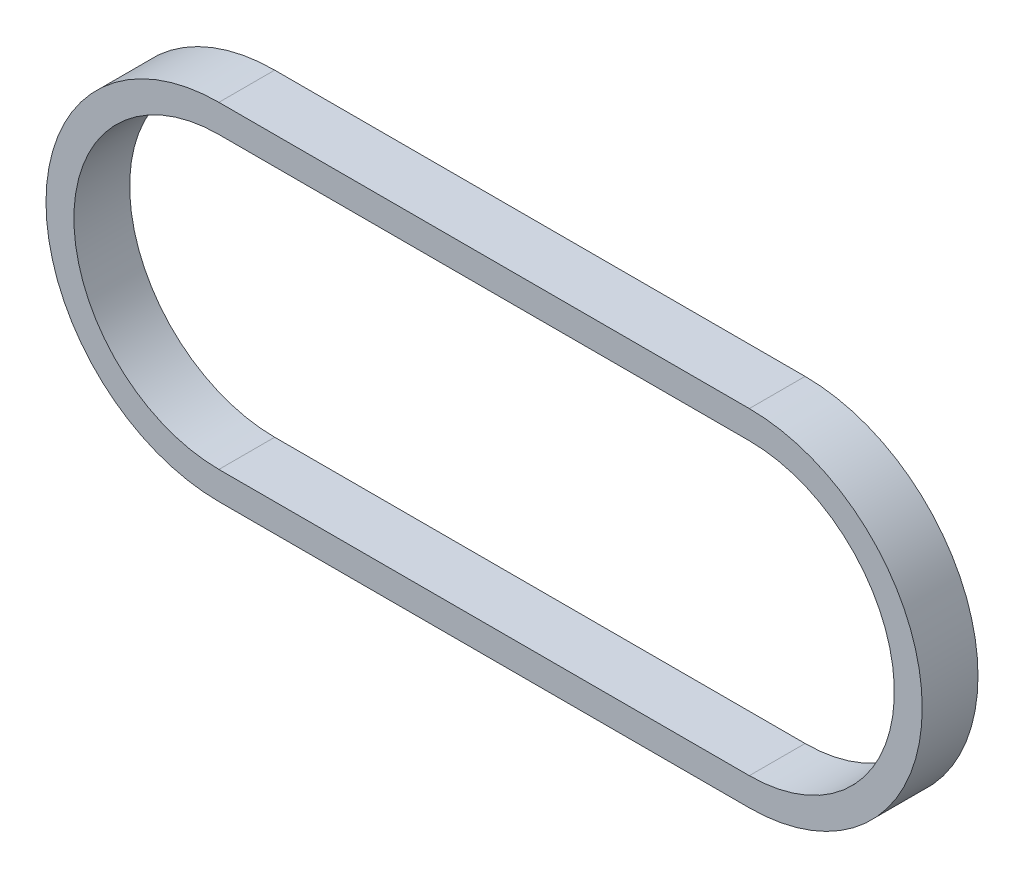
ISO-10303-21;
HEADER;
FILE_DESCRIPTION(('STEP AP214'),'2;1');
FILE_NAME('part.step','',(''),(''),'','','');
FILE_SCHEMA(('AUTOMOTIVE_DESIGN { 1 0 10303 214 1 1 1 1 }'));
ENDSEC;
DATA;
#1=APPLICATION_CONTEXT('core data for automotive mechanical design processes');
#2=APPLICATION_PROTOCOL_DEFINITION('international standard','automotive_design',2000,#1);
#3=PRODUCT_CONTEXT('',#1,'mechanical');
#4=PRODUCT('Part','Part','',(#3));
#5=PRODUCT_RELATED_PRODUCT_CATEGORY('part','',(#4));
#6=PRODUCT_DEFINITION_FORMATION('','',#4);
#7=PRODUCT_DEFINITION_CONTEXT('part definition',#1,'design');
#8=PRODUCT_DEFINITION('design','',#6,#7);
#9=PRODUCT_DEFINITION_SHAPE('','',#8);
#10=(LENGTH_UNIT() NAMED_UNIT(*) SI_UNIT(.MILLI.,.METRE.));
#11=(NAMED_UNIT(*) PLANE_ANGLE_UNIT() SI_UNIT($,.RADIAN.));
#12=(NAMED_UNIT(*) SI_UNIT($,.STERADIAN.) SOLID_ANGLE_UNIT());
#13=UNCERTAINTY_MEASURE_WITH_UNIT(LENGTH_MEASURE(1.E-05),#10,'distance_accuracy_value','');
#14=(GEOMETRIC_REPRESENTATION_CONTEXT(3) GLOBAL_UNCERTAINTY_ASSIGNED_CONTEXT((#13)) GLOBAL_UNIT_ASSIGNED_CONTEXT((#10,
#11,#12)) REPRESENTATION_CONTEXT('',''));
#15=CARTESIAN_POINT('',(0.,0.,0.));
#16=DIRECTION('',(0.,0.,1.));
#17=DIRECTION('',(1.,0.,0.));
#18=AXIS2_PLACEMENT_3D('',#15,#16,#17);
#19=CARTESIAN_POINT('',(0.,0.,10.));
#20=DIRECTION('',(0.,0.,1.));
#21=DIRECTION('',(1.,0.,0.));
#22=AXIS2_PLACEMENT_3D('',#19,#20,#21);
#23=PLANE('',#22);
#24=CARTESIAN_POINT('',(0.,0.,10.));
#25=DIRECTION('',(0.,0.,1.));
#26=DIRECTION('',(1.,0.,0.));
#27=AXIS2_PLACEMENT_3D('',#24,#25,#26);
#28=CIRCLE('',#27,31.);
#29=CARTESIAN_POINT('',(0.,31.,10.));
#30=VERTEX_POINT('',#29);
#31=CARTESIAN_POINT('',(0.,-31.,10.));
#32=VERTEX_POINT('',#31);
#33=EDGE_CURVE('E147',#30,#32,#28,.T.);
#34=ORIENTED_EDGE('',*,*,#33,.T.);
#35=DIRECTION('',(1.,0.,0.));
#36=VECTOR('',#35,1.);
#37=CARTESIAN_POINT('',(0.,-31.,10.));
#38=LINE('',#37,#36);
#39=CARTESIAN_POINT('',(95.1,-31.,10.));
#40=VERTEX_POINT('',#39);
#41=EDGE_CURVE('E150',#32,#40,#38,.T.);
#42=ORIENTED_EDGE('',*,*,#41,.T.);
#43=CARTESIAN_POINT('',(95.1,0.,10.));
#44=DIRECTION('',(0.,0.,1.));
#45=DIRECTION('',(1.,0.,0.));
#46=AXIS2_PLACEMENT_3D('',#43,#44,#45);
#47=CIRCLE('',#46,31.);
#48=CARTESIAN_POINT('',(95.1,31.,10.));
#49=VERTEX_POINT('',#48);
#50=EDGE_CURVE('E153',#40,#49,#47,.T.);
#51=ORIENTED_EDGE('',*,*,#50,.T.);
#52=DIRECTION('',(-1.,0.,0.));
#53=VECTOR('',#52,1.);
#54=CARTESIAN_POINT('',(0.,31.,10.));
#55=LINE('',#54,#53);
#56=EDGE_CURVE('E155',#49,#30,#55,.T.);
#57=ORIENTED_EDGE('',*,*,#56,.T.);
#58=EDGE_LOOP('',(#34,#42,#51,#57));
#59=FACE_BOUND('',#58,.T.);
#60=DIRECTION('',(1.,0.,0.));
#61=VECTOR('',#60,1.);
#62=CARTESIAN_POINT('',(0.,-26.,10.));
#63=LINE('',#62,#61);
#64=CARTESIAN_POINT('',(0.,-26.,10.));
#65=VERTEX_POINT('',#64);
#66=CARTESIAN_POINT('',(95.1,-26.,10.));
#67=VERTEX_POINT('',#66);
#68=EDGE_CURVE('E119',#65,#67,#63,.T.);
#69=ORIENTED_EDGE('',*,*,#68,.F.);
#70=CARTESIAN_POINT('',(0.,0.,10.));
#71=DIRECTION('',(0.,0.,1.));
#72=DIRECTION('',(1.,0.,0.));
#73=AXIS2_PLACEMENT_3D('',#70,#71,#72);
#74=CIRCLE('',#73,26.);
#75=CARTESIAN_POINT('',(0.,26.,10.));
#76=VERTEX_POINT('',#75);
#77=EDGE_CURVE('E111',#76,#65,#74,.T.);
#78=ORIENTED_EDGE('',*,*,#77,.F.);
#79=DIRECTION('',(-1.,0.,0.));
#80=VECTOR('',#79,1.);
#81=CARTESIAN_POINT('',(0.,26.,10.));
#82=LINE('',#81,#80);
#83=CARTESIAN_POINT('',(95.1,26.,10.));
#84=VERTEX_POINT('',#83);
#85=EDGE_CURVE('E133',#84,#76,#82,.T.);
#86=ORIENTED_EDGE('',*,*,#85,.F.);
#87=CARTESIAN_POINT('',(95.1,0.,10.));
#88=DIRECTION('',(0.,0.,1.));
#89=DIRECTION('',(1.,0.,0.));
#90=AXIS2_PLACEMENT_3D('',#87,#88,#89);
#91=CIRCLE('',#90,26.);
#92=EDGE_CURVE('E131',#67,#84,#91,.T.);
#93=ORIENTED_EDGE('',*,*,#92,.F.);
#94=EDGE_LOOP('',(#69,#78,#86,#93));
#95=FACE_BOUND('',#94,.T.);
#96=ADVANCED_FACE('F46',(#59,#95),#23,.T.);
#97=CARTESIAN_POINT('',(0.,0.,0.));
#98=DIRECTION('',(0.,0.,1.));
#99=DIRECTION('',(1.,0.,0.));
#100=AXIS2_PLACEMENT_3D('',#97,#98,#99);
#101=PLANE('',#100);
#102=CARTESIAN_POINT('',(0.,0.,0.));
#103=DIRECTION('',(0.,0.,1.));
#104=DIRECTION('',(1.,0.,0.));
#105=AXIS2_PLACEMENT_3D('',#102,#103,#104);
#106=CIRCLE('',#105,31.);
#107=CARTESIAN_POINT('',(0.,31.,0.));
#108=VERTEX_POINT('',#107);
#109=CARTESIAN_POINT('',(0.,-31.,0.));
#110=VERTEX_POINT('',#109);
#111=EDGE_CURVE('E127',#108,#110,#106,.T.);
#112=ORIENTED_EDGE('',*,*,#111,.F.);
#113=DIRECTION('',(-1.,0.,0.));
#114=VECTOR('',#113,1.);
#115=CARTESIAN_POINT('',(0.,31.,0.));
#116=LINE('',#115,#114);
#117=CARTESIAN_POINT('',(95.1,31.,0.));
#118=VERTEX_POINT('',#117);
#119=EDGE_CURVE('E151',#118,#108,#116,.T.);
#120=ORIENTED_EDGE('',*,*,#119,.F.);
#121=CARTESIAN_POINT('',(95.1,0.,0.));
#122=DIRECTION('',(0.,0.,1.));
#123=DIRECTION('',(1.,0.,0.));
#124=AXIS2_PLACEMENT_3D('',#121,#122,#123);
#125=CIRCLE('',#124,31.);
#126=CARTESIAN_POINT('',(95.1,-31.,0.));
#127=VERTEX_POINT('',#126);
#128=EDGE_CURVE('E162',#127,#118,#125,.T.);
#129=ORIENTED_EDGE('',*,*,#128,.F.);
#130=DIRECTION('',(1.,0.,0.));
#131=VECTOR('',#130,1.);
#132=CARTESIAN_POINT('',(0.,-31.,0.));
#133=LINE('',#132,#131);
#134=EDGE_CURVE('E160',#110,#127,#133,.T.);
#135=ORIENTED_EDGE('',*,*,#134,.F.);
#136=EDGE_LOOP('',(#112,#120,#129,#135));
#137=FACE_BOUND('',#136,.T.);
#138=CARTESIAN_POINT('',(0.,0.,0.));
#139=DIRECTION('',(0.,0.,1.));
#140=DIRECTION('',(1.,0.,0.));
#141=AXIS2_PLACEMENT_3D('',#138,#139,#140);
#142=CIRCLE('',#141,26.);
#143=CARTESIAN_POINT('',(0.,26.,0.));
#144=VERTEX_POINT('',#143);
#145=CARTESIAN_POINT('',(0.,-26.,0.));
#146=VERTEX_POINT('',#145);
#147=EDGE_CURVE('E69',#144,#146,#142,.T.);
#148=ORIENTED_EDGE('',*,*,#147,.T.);
#149=DIRECTION('',(1.,0.,0.));
#150=VECTOR('',#149,1.);
#151=CARTESIAN_POINT('',(0.,-26.,0.));
#152=LINE('',#151,#150);
#153=CARTESIAN_POINT('',(95.1,-26.,0.));
#154=VERTEX_POINT('',#153);
#155=EDGE_CURVE('E126',#146,#154,#152,.T.);
#156=ORIENTED_EDGE('',*,*,#155,.T.);
#157=CARTESIAN_POINT('',(95.1,0.,0.));
#158=DIRECTION('',(0.,0.,1.));
#159=DIRECTION('',(1.,0.,0.));
#160=AXIS2_PLACEMENT_3D('',#157,#158,#159);
#161=CIRCLE('',#160,26.);
#162=CARTESIAN_POINT('',(95.1,26.,0.));
#163=VERTEX_POINT('',#162);
#164=EDGE_CURVE('E139',#154,#163,#161,.T.);
#165=ORIENTED_EDGE('',*,*,#164,.T.);
#166=DIRECTION('',(-1.,0.,0.));
#167=VECTOR('',#166,1.);
#168=CARTESIAN_POINT('',(0.,26.,0.));
#169=LINE('',#168,#167);
#170=EDGE_CURVE('E120',#163,#144,#169,.T.);
#171=ORIENTED_EDGE('',*,*,#170,.T.);
#172=EDGE_LOOP('',(#148,#156,#165,#171));
#173=FACE_BOUND('',#172,.T.);
#174=ADVANCED_FACE('F180',(#137,#173),#101,.F.);
#175=CARTESIAN_POINT('',(0.,0.,10.));
#176=DIRECTION('',(0.,0.,-1.));
#177=DIRECTION('',(-1.,0.,0.));
#178=AXIS2_PLACEMENT_3D('',#175,#176,#177);
#179=CYLINDRICAL_SURFACE('',#178,31.);
#180=ORIENTED_EDGE('',*,*,#111,.T.);
#181=DIRECTION('',(0.,0.,-1.));
#182=VECTOR('',#181,1.);
#183=CARTESIAN_POINT('',(0.,-31.,10.));
#184=LINE('',#183,#182);
#185=EDGE_CURVE('E13',#32,#110,#184,.T.);
#186=ORIENTED_EDGE('',*,*,#185,.F.);
#187=ORIENTED_EDGE('',*,*,#33,.F.);
#188=DIRECTION('',(0.,0.,-1.));
#189=VECTOR('',#188,1.);
#190=CARTESIAN_POINT('',(0.,31.,10.));
#191=LINE('',#190,#189);
#192=EDGE_CURVE('E157',#30,#108,#191,.T.);
#193=ORIENTED_EDGE('',*,*,#192,.T.);
#194=EDGE_LOOP('',(#180,#186,#187,#193));
#195=FACE_BOUND('',#194,.T.);
#196=ADVANCED_FACE('F48',(#195),#179,.T.);
#197=CARTESIAN_POINT('',(0.,-31.,10.));
#198=DIRECTION('',(0.,1.,0.));
#199=DIRECTION('',(0.,0.,1.));
#200=AXIS2_PLACEMENT_3D('',#197,#198,#199);
#201=PLANE('',#200);
#202=ORIENTED_EDGE('',*,*,#134,.T.);
#203=DIRECTION('',(0.,0.,-1.));
#204=VECTOR('',#203,1.);
#205=CARTESIAN_POINT('',(95.1,-31.,10.));
#206=LINE('',#205,#204);
#207=EDGE_CURVE('E54',#40,#127,#206,.T.);
#208=ORIENTED_EDGE('',*,*,#207,.F.);
#209=ORIENTED_EDGE('',*,*,#41,.F.);
#210=ORIENTED_EDGE('',*,*,#185,.T.);
#211=EDGE_LOOP('',(#202,#208,#209,#210));
#212=FACE_BOUND('',#211,.T.);
#213=ADVANCED_FACE('F190',(#212),#201,.F.);
#214=CARTESIAN_POINT('',(95.1,0.,10.));
#215=DIRECTION('',(0.,0.,-1.));
#216=DIRECTION('',(-1.,0.,0.));
#217=AXIS2_PLACEMENT_3D('',#214,#215,#216);
#218=CYLINDRICAL_SURFACE('',#217,31.);
#219=ORIENTED_EDGE('',*,*,#128,.T.);
#220=DIRECTION('',(0.,0.,-1.));
#221=VECTOR('',#220,1.);
#222=CARTESIAN_POINT('',(95.1,31.,10.));
#223=LINE('',#222,#221);
#224=EDGE_CURVE('E167',#49,#118,#223,.T.);
#225=ORIENTED_EDGE('',*,*,#224,.F.);
#226=ORIENTED_EDGE('',*,*,#50,.F.);
#227=ORIENTED_EDGE('',*,*,#207,.T.);
#228=EDGE_LOOP('',(#219,#225,#226,#227));
#229=FACE_BOUND('',#228,.T.);
#230=ADVANCED_FACE('F174',(#229),#218,.T.);
#231=CARTESIAN_POINT('',(0.,31.,10.));
#232=DIRECTION('',(0.,-1.,0.));
#233=DIRECTION('',(0.,0.,-1.));
#234=AXIS2_PLACEMENT_3D('',#231,#232,#233);
#235=PLANE('',#234);
#236=ORIENTED_EDGE('',*,*,#119,.T.);
#237=ORIENTED_EDGE('',*,*,#192,.F.);
#238=ORIENTED_EDGE('',*,*,#56,.F.);
#239=ORIENTED_EDGE('',*,*,#224,.T.);
#240=EDGE_LOOP('',(#236,#237,#238,#239));
#241=FACE_BOUND('',#240,.T.);
#242=ADVANCED_FACE('F184',(#241),#235,.F.);
#243=CARTESIAN_POINT('',(0.,0.,10.));
#244=DIRECTION('',(0.,0.,-1.));
#245=DIRECTION('',(-1.,0.,0.));
#246=AXIS2_PLACEMENT_3D('',#243,#244,#245);
#247=CYLINDRICAL_SURFACE('',#246,26.);
#248=ORIENTED_EDGE('',*,*,#147,.F.);
#249=DIRECTION('',(0.,0.,-1.));
#250=VECTOR('',#249,1.);
#251=CARTESIAN_POINT('',(0.,26.,10.));
#252=LINE('',#251,#250);
#253=EDGE_CURVE('E115',#76,#144,#252,.T.);
#254=ORIENTED_EDGE('',*,*,#253,.F.);
#255=ORIENTED_EDGE('',*,*,#77,.T.);
#256=DIRECTION('',(0.,0.,-1.));
#257=VECTOR('',#256,1.);
#258=CARTESIAN_POINT('',(0.,-26.,10.));
#259=LINE('',#258,#257);
#260=EDGE_CURVE('E114',#65,#146,#259,.T.);
#261=ORIENTED_EDGE('',*,*,#260,.T.);
#262=EDGE_LOOP('',(#248,#254,#255,#261));
#263=FACE_BOUND('',#262,.T.);
#264=ADVANCED_FACE('F113',(#263),#247,.F.);
#265=CARTESIAN_POINT('',(0.,-26.,10.));
#266=DIRECTION('',(0.,1.,0.));
#267=DIRECTION('',(0.,0.,1.));
#268=AXIS2_PLACEMENT_3D('',#265,#266,#267);
#269=PLANE('',#268);
#270=ORIENTED_EDGE('',*,*,#155,.F.);
#271=ORIENTED_EDGE('',*,*,#260,.F.);
#272=ORIENTED_EDGE('',*,*,#68,.T.);
#273=DIRECTION('',(0.,0.,-1.));
#274=VECTOR('',#273,1.);
#275=CARTESIAN_POINT('',(95.1,-26.,10.));
#276=LINE('',#275,#274);
#277=EDGE_CURVE('E128',#67,#154,#276,.T.);
#278=ORIENTED_EDGE('',*,*,#277,.T.);
#279=EDGE_LOOP('',(#270,#271,#272,#278));
#280=FACE_BOUND('',#279,.T.);
#281=ADVANCED_FACE('F123',(#280),#269,.T.);
#282=CARTESIAN_POINT('',(95.1,0.,10.));
#283=DIRECTION('',(0.,0.,-1.));
#284=DIRECTION('',(-1.,0.,0.));
#285=AXIS2_PLACEMENT_3D('',#282,#283,#284);
#286=CYLINDRICAL_SURFACE('',#285,26.);
#287=ORIENTED_EDGE('',*,*,#164,.F.);
#288=ORIENTED_EDGE('',*,*,#277,.F.);
#289=ORIENTED_EDGE('',*,*,#92,.T.);
#290=DIRECTION('',(0.,0.,-1.));
#291=VECTOR('',#290,1.);
#292=CARTESIAN_POINT('',(95.1,26.,10.));
#293=LINE('',#292,#291);
#294=EDGE_CURVE('E61',#84,#163,#293,.T.);
#295=ORIENTED_EDGE('',*,*,#294,.T.);
#296=EDGE_LOOP('',(#287,#288,#289,#295));
#297=FACE_BOUND('',#296,.T.);
#298=ADVANCED_FACE('F213',(#297),#286,.F.);
#299=CARTESIAN_POINT('',(0.,26.,10.));
#300=DIRECTION('',(0.,-1.,0.));
#301=DIRECTION('',(0.,0.,-1.));
#302=AXIS2_PLACEMENT_3D('',#299,#300,#301);
#303=PLANE('',#302);
#304=ORIENTED_EDGE('',*,*,#170,.F.);
#305=ORIENTED_EDGE('',*,*,#294,.F.);
#306=ORIENTED_EDGE('',*,*,#85,.T.);
#307=ORIENTED_EDGE('',*,*,#253,.T.);
#308=EDGE_LOOP('',(#304,#305,#306,#307));
#309=FACE_BOUND('',#308,.T.);
#310=ADVANCED_FACE('F217',(#309),#303,.T.);
#311=CLOSED_SHELL('',(#96,#174,#196,#213,#230,#242,#264,#281,#298,#310));
#312=MANIFOLD_SOLID_BREP('B2',#311);
#313=ADVANCED_BREP_SHAPE_REPRESENTATION('',(#18,#312),#14);
#314=SHAPE_DEFINITION_REPRESENTATION(#9,#313);
ENDSEC;
END-ISO-10303-21;
